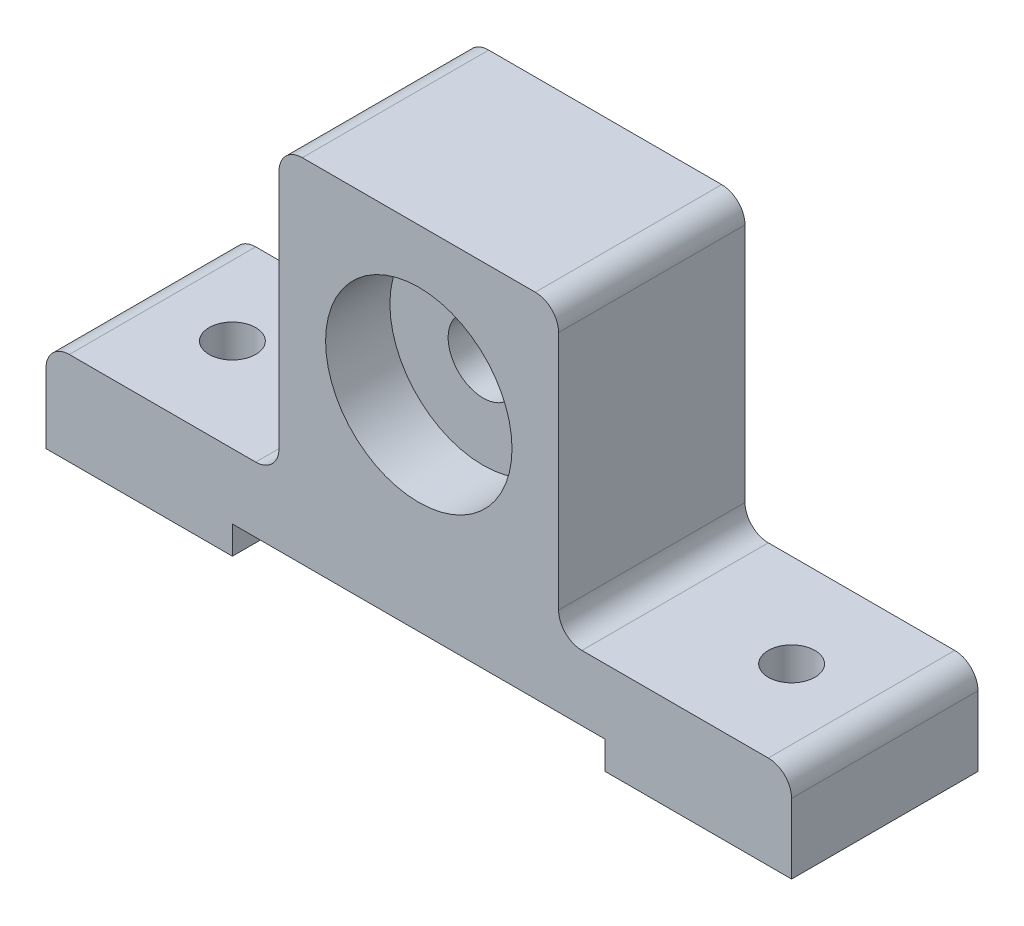
ISO-10303-21;
HEADER;
FILE_DESCRIPTION(('STEP AP214'),'2;1');
FILE_NAME('part.step','',(''),(''),'','','');
FILE_SCHEMA(('AUTOMOTIVE_DESIGN { 1 0 10303 214 1 1 1 1 }'));
ENDSEC;
DATA;
#1=APPLICATION_CONTEXT('core data for automotive mechanical design processes');
#2=APPLICATION_PROTOCOL_DEFINITION('international standard','automotive_design',2000,#1);
#3=PRODUCT_CONTEXT('',#1,'mechanical');
#4=PRODUCT('Part','Part','',(#3));
#5=PRODUCT_RELATED_PRODUCT_CATEGORY('part','',(#4));
#6=PRODUCT_DEFINITION_FORMATION('','',#4);
#7=PRODUCT_DEFINITION_CONTEXT('part definition',#1,'design');
#8=PRODUCT_DEFINITION('design','',#6,#7);
#9=PRODUCT_DEFINITION_SHAPE('','',#8);
#10=(LENGTH_UNIT() NAMED_UNIT(*) SI_UNIT(.MILLI.,.METRE.));
#11=(NAMED_UNIT(*) PLANE_ANGLE_UNIT() SI_UNIT($,.RADIAN.));
#12=(NAMED_UNIT(*) SI_UNIT($,.STERADIAN.) SOLID_ANGLE_UNIT());
#13=UNCERTAINTY_MEASURE_WITH_UNIT(LENGTH_MEASURE(1.E-05),#10,'distance_accuracy_value','');
#14=(GEOMETRIC_REPRESENTATION_CONTEXT(3) GLOBAL_UNCERTAINTY_ASSIGNED_CONTEXT((#13)) GLOBAL_UNIT_ASSIGNED_CONTEXT((#10,
#11,#12)) REPRESENTATION_CONTEXT('',''));
#15=CARTESIAN_POINT('',(0.,0.,0.));
#16=DIRECTION('',(0.,0.,1.));
#17=DIRECTION('',(1.,0.,0.));
#18=AXIS2_PLACEMENT_3D('',#15,#16,#17);
#19=CARTESIAN_POINT('',(101.6,63.5,-50.8));
#20=DIRECTION('',(0.,0.,1.));
#21=DIRECTION('',(1.,0.,0.));
#22=AXIS2_PLACEMENT_3D('',#19,#20,#21);
#23=CYLINDRICAL_SURFACE('',#22,9.52500000000001);
#24=CARTESIAN_POINT('',(101.6,63.5,-50.8));
#25=DIRECTION('',(0.,0.,1.));
#26=DIRECTION('',(1.,0.,0.));
#27=AXIS2_PLACEMENT_3D('',#24,#25,#26);
#28=CIRCLE('',#27,9.52500000000001);
#29=CARTESIAN_POINT('',(111.125,63.5,-50.8));
#30=VERTEX_POINT('',#29);
#31=EDGE_CURVE('E216',#30,#30,#28,.T.);
#32=ORIENTED_EDGE('',*,*,#31,.F.);
#33=EDGE_LOOP('',(#32));
#34=FACE_BOUND('',#33,.T.);
#35=CARTESIAN_POINT('',(101.6,63.5,-17.526));
#36=DIRECTION('',(0.,0.,1.));
#37=DIRECTION('',(1.,0.,0.));
#38=AXIS2_PLACEMENT_3D('',#35,#36,#37);
#39=CIRCLE('',#38,9.52500000000001);
#40=CARTESIAN_POINT('',(111.125,63.5,-17.526));
#41=VERTEX_POINT('',#40);
#42=EDGE_CURVE('E48',#41,#41,#39,.F.);
#43=ORIENTED_EDGE('',*,*,#42,.F.);
#44=EDGE_LOOP('',(#43));
#45=FACE_BOUND('',#44,.T.);
#46=ADVANCED_FACE('F44',(#34,#45),#23,.F.);
#47=CARTESIAN_POINT('',(0.,0.,-50.8));
#48=DIRECTION('',(-1.,0.,0.));
#49=DIRECTION('',(0.,0.,1.));
#50=AXIS2_PLACEMENT_3D('',#47,#48,#49);
#51=PLANE('',#50);
#52=DIRECTION('',(0.,-1.,0.));
#53=VECTOR('',#52,1.);
#54=CARTESIAN_POINT('',(0.,0.,0.));
#55=LINE('',#54,#53);
#56=CARTESIAN_POINT('',(0.,19.05,0.));
#57=VERTEX_POINT('',#56);
#58=CARTESIAN_POINT('',(0.,0.,0.));
#59=VERTEX_POINT('',#58);
#60=EDGE_CURVE('E211',#57,#59,#55,.T.);
#61=ORIENTED_EDGE('',*,*,#60,.F.);
#62=DIRECTION('',(0.,0.,1.));
#63=VECTOR('',#62,1.);
#64=CARTESIAN_POINT('',(0.,19.05,-50.8));
#65=LINE('',#64,#63);
#66=CARTESIAN_POINT('',(0.,19.05,-50.8));
#67=VERTEX_POINT('',#66);
#68=EDGE_CURVE('E11',#67,#57,#65,.T.);
#69=ORIENTED_EDGE('',*,*,#68,.F.);
#70=DIRECTION('',(0.,-1.,0.));
#71=VECTOR('',#70,1.);
#72=CARTESIAN_POINT('',(0.,0.,-50.8));
#73=LINE('',#72,#71);
#74=CARTESIAN_POINT('',(0.,0.,-50.8));
#75=VERTEX_POINT('',#74);
#76=EDGE_CURVE('E280',#67,#75,#73,.T.);
#77=ORIENTED_EDGE('',*,*,#76,.T.);
#78=DIRECTION('',(0.,0.,1.));
#79=VECTOR('',#78,1.);
#80=CARTESIAN_POINT('',(0.,0.,-50.8));
#81=LINE('',#80,#79);
#82=EDGE_CURVE('E132',#75,#59,#81,.T.);
#83=ORIENTED_EDGE('',*,*,#82,.T.);
#84=EDGE_LOOP('',(#61,#69,#77,#83));
#85=FACE_BOUND('',#84,.T.);
#86=ADVANCED_FACE('F46',(#85),#51,.T.);
#87=CARTESIAN_POINT('',(6.35,19.05,-50.8));
#88=DIRECTION('',(0.,0.,1.));
#89=DIRECTION('',(1.,0.,0.));
#90=AXIS2_PLACEMENT_3D('',#87,#88,#89);
#91=CYLINDRICAL_SURFACE('',#90,6.35);
#92=CARTESIAN_POINT('',(6.35,19.05,0.));
#93=DIRECTION('',(0.,0.,1.));
#94=DIRECTION('',(1.,0.,0.));
#95=AXIS2_PLACEMENT_3D('',#92,#93,#94);
#96=CIRCLE('',#95,6.35);
#97=CARTESIAN_POINT('',(6.35000000000004,25.4,0.));
#98=VERTEX_POINT('',#97);
#99=EDGE_CURVE('E277',#98,#57,#96,.T.);
#100=ORIENTED_EDGE('',*,*,#99,.F.);
#101=DIRECTION('',(0.,0.,1.));
#102=VECTOR('',#101,1.);
#103=CARTESIAN_POINT('',(6.35000000000004,25.4,-50.8));
#104=LINE('',#103,#102);
#105=CARTESIAN_POINT('',(6.35000000000004,25.4,-50.8));
#106=VERTEX_POINT('',#105);
#107=EDGE_CURVE('E55',#106,#98,#104,.T.);
#108=ORIENTED_EDGE('',*,*,#107,.F.);
#109=CARTESIAN_POINT('',(6.35,19.05,-50.8));
#110=DIRECTION('',(0.,0.,1.));
#111=DIRECTION('',(1.,0.,0.));
#112=AXIS2_PLACEMENT_3D('',#109,#110,#111);
#113=CIRCLE('',#112,6.35);
#114=EDGE_CURVE('E195',#106,#67,#113,.T.);
#115=ORIENTED_EDGE('',*,*,#114,.T.);
#116=ORIENTED_EDGE('',*,*,#68,.T.);
#117=EDGE_LOOP('',(#100,#108,#115,#116));
#118=FACE_BOUND('',#117,.T.);
#119=ADVANCED_FACE('F331',(#118),#91,.T.);
#120=CARTESIAN_POINT('',(6.35000000000004,25.4,-50.8));
#121=DIRECTION('',(0.,1.,0.));
#122=DIRECTION('',(0.,0.,1.));
#123=AXIS2_PLACEMENT_3D('',#120,#121,#122);
#124=PLANE('',#123);
#125=CARTESIAN_POINT('',(25.4,25.4,-25.4));
#126=DIRECTION('',(0.,1.,0.));
#127=DIRECTION('',(0.,0.,1.));
#128=AXIS2_PLACEMENT_3D('',#125,#126,#127);
#129=CIRCLE('',#128,6.35);
#130=CARTESIAN_POINT('',(25.4,25.4,-19.05));
#131=VERTEX_POINT('',#130);
#132=EDGE_CURVE('E376',#131,#131,#129,.T.);
#133=ORIENTED_EDGE('',*,*,#132,.F.);
#134=EDGE_LOOP('',(#133));
#135=FACE_BOUND('',#134,.T.);
#136=DIRECTION('',(-1.,0.,0.));
#137=VECTOR('',#136,1.);
#138=CARTESIAN_POINT('',(6.35000000000004,25.4,0.));
#139=LINE('',#138,#137);
#140=CARTESIAN_POINT('',(57.15,25.4,0.));
#141=VERTEX_POINT('',#140);
#142=EDGE_CURVE('E181',#141,#98,#139,.T.);
#143=ORIENTED_EDGE('',*,*,#142,.F.);
#144=DIRECTION('',(0.,0.,1.));
#145=VECTOR('',#144,1.);
#146=CARTESIAN_POINT('',(57.15,25.4,-50.8));
#147=LINE('',#146,#145);
#148=CARTESIAN_POINT('',(57.15,25.4,-50.8));
#149=VERTEX_POINT('',#148);
#150=EDGE_CURVE('E176',#149,#141,#147,.T.);
#151=ORIENTED_EDGE('',*,*,#150,.F.);
#152=DIRECTION('',(-1.,0.,0.));
#153=VECTOR('',#152,1.);
#154=CARTESIAN_POINT('',(6.35000000000004,25.4,-50.8));
#155=LINE('',#154,#153);
#156=EDGE_CURVE('E179',#149,#106,#155,.T.);
#157=ORIENTED_EDGE('',*,*,#156,.T.);
#158=ORIENTED_EDGE('',*,*,#107,.T.);
#159=EDGE_LOOP('',(#143,#151,#157,#158));
#160=FACE_BOUND('',#159,.T.);
#161=ADVANCED_FACE('F178',(#135,#160),#124,.T.);
#162=CARTESIAN_POINT('',(57.15,31.75,-50.8));
#163=DIRECTION('',(0.,0.,1.));
#164=DIRECTION('',(1.,0.,0.));
#165=AXIS2_PLACEMENT_3D('',#162,#163,#164);
#166=CYLINDRICAL_SURFACE('',#165,6.35);
#167=CARTESIAN_POINT('',(57.15,31.75,0.));
#168=DIRECTION('',(0.,0.,-1.));
#169=DIRECTION('',(1.,0.,0.));
#170=AXIS2_PLACEMENT_3D('',#167,#168,#169);
#171=CIRCLE('',#170,6.35);
#172=CARTESIAN_POINT('',(63.5,31.75,0.));
#173=VERTEX_POINT('',#172);
#174=EDGE_CURVE('E272',#173,#141,#171,.T.);
#175=ORIENTED_EDGE('',*,*,#174,.F.);
#176=DIRECTION('',(0.,0.,1.));
#177=VECTOR('',#176,1.);
#178=CARTESIAN_POINT('',(63.5,31.75,-50.8));
#179=LINE('',#178,#177);
#180=CARTESIAN_POINT('',(63.5,31.75,-50.8));
#181=VERTEX_POINT('',#180);
#182=EDGE_CURVE('E187',#181,#173,#179,.T.);
#183=ORIENTED_EDGE('',*,*,#182,.F.);
#184=CARTESIAN_POINT('',(57.15,31.75,-50.8));
#185=DIRECTION('',(0.,0.,-1.));
#186=DIRECTION('',(1.,0.,0.));
#187=AXIS2_PLACEMENT_3D('',#184,#185,#186);
#188=CIRCLE('',#187,6.35);
#189=EDGE_CURVE('E193',#181,#149,#188,.T.);
#190=ORIENTED_EDGE('',*,*,#189,.T.);
#191=ORIENTED_EDGE('',*,*,#150,.T.);
#192=EDGE_LOOP('',(#175,#183,#190,#191));
#193=FACE_BOUND('',#192,.T.);
#194=ADVANCED_FACE('F198',(#193),#166,.F.);
#195=CARTESIAN_POINT('',(63.5,31.75,-50.8));
#196=DIRECTION('',(-1.,0.,0.));
#197=DIRECTION('',(0.,0.,1.));
#198=AXIS2_PLACEMENT_3D('',#195,#196,#197);
#199=PLANE('',#198);
#200=DIRECTION('',(0.,-1.,0.));
#201=VECTOR('',#200,1.);
#202=CARTESIAN_POINT('',(63.5,31.75,0.));
#203=LINE('',#202,#201);
#204=CARTESIAN_POINT('',(63.5,97.2433828797224,0.));
#205=VERTEX_POINT('',#204);
#206=EDGE_CURVE('E268',#205,#173,#203,.T.);
#207=ORIENTED_EDGE('',*,*,#206,.F.);
#208=DIRECTION('',(0.,0.,1.));
#209=VECTOR('',#208,1.);
#210=CARTESIAN_POINT('',(63.5,97.2433828797224,-50.8));
#211=LINE('',#210,#209);
#212=CARTESIAN_POINT('',(63.5,97.2433828797224,-50.8));
#213=VERTEX_POINT('',#212);
#214=EDGE_CURVE('E286',#213,#205,#211,.T.);
#215=ORIENTED_EDGE('',*,*,#214,.F.);
#216=DIRECTION('',(0.,-1.,0.));
#217=VECTOR('',#216,1.);
#218=CARTESIAN_POINT('',(63.5,31.75,-50.8));
#219=LINE('',#218,#217);
#220=EDGE_CURVE('E200',#213,#181,#219,.T.);
#221=ORIENTED_EDGE('',*,*,#220,.T.);
#222=ORIENTED_EDGE('',*,*,#182,.T.);
#223=EDGE_LOOP('',(#207,#215,#221,#222));
#224=FACE_BOUND('',#223,.T.);
#225=ADVANCED_FACE('F484',(#224),#199,.T.);
#226=CARTESIAN_POINT('',(69.85,97.2433828797224,-50.8));
#227=DIRECTION('',(0.,0.,1.));
#228=DIRECTION('',(1.,0.,0.));
#229=AXIS2_PLACEMENT_3D('',#226,#227,#228);
#230=CYLINDRICAL_SURFACE('',#229,6.34999999999999);
#231=CARTESIAN_POINT('',(69.85,97.2433828797224,0.));
#232=DIRECTION('',(0.,0.,1.));
#233=DIRECTION('',(-1.,0.,0.));
#234=AXIS2_PLACEMENT_3D('',#231,#232,#233);
#235=CIRCLE('',#234,6.34999999999999);
#236=CARTESIAN_POINT('',(69.8500000000001,103.593382879722,0.));
#237=VERTEX_POINT('',#236);
#238=EDGE_CURVE('E264',#237,#205,#235,.T.);
#239=ORIENTED_EDGE('',*,*,#238,.F.);
#240=DIRECTION('',(0.,0.,1.));
#241=VECTOR('',#240,1.);
#242=CARTESIAN_POINT('',(69.8500000000001,103.593382879722,-50.8));
#243=LINE('',#242,#241);
#244=CARTESIAN_POINT('',(69.8500000000001,103.593382879722,-50.8));
#245=VERTEX_POINT('',#244);
#246=EDGE_CURVE('E289',#245,#237,#243,.T.);
#247=ORIENTED_EDGE('',*,*,#246,.F.);
#248=CARTESIAN_POINT('',(69.85,97.2433828797224,-50.8));
#249=DIRECTION('',(0.,0.,1.));
#250=DIRECTION('',(-1.,0.,0.));
#251=AXIS2_PLACEMENT_3D('',#248,#249,#250);
#252=CIRCLE('',#251,6.34999999999999);
#253=EDGE_CURVE('E205',#245,#213,#252,.T.);
#254=ORIENTED_EDGE('',*,*,#253,.T.);
#255=ORIENTED_EDGE('',*,*,#214,.T.);
#256=EDGE_LOOP('',(#239,#247,#254,#255));
#257=FACE_BOUND('',#256,.T.);
#258=ADVANCED_FACE('F438',(#257),#230,.T.);
#259=CARTESIAN_POINT('',(69.8500000000001,103.593382879722,-50.8));
#260=DIRECTION('',(0.,1.,0.));
#261=DIRECTION('',(0.,0.,1.));
#262=AXIS2_PLACEMENT_3D('',#259,#260,#261);
#263=PLANE('',#262);
#264=DIRECTION('',(-1.,0.,0.));
#265=VECTOR('',#264,1.);
#266=CARTESIAN_POINT('',(69.8500000000001,103.593382879722,0.));
#267=LINE('',#266,#265);
#268=CARTESIAN_POINT('',(133.35,103.593382879722,0.));
#269=VERTEX_POINT('',#268);
#270=EDGE_CURVE('E260',#269,#237,#267,.T.);
#271=ORIENTED_EDGE('',*,*,#270,.F.);
#272=DIRECTION('',(0.,0.,1.));
#273=VECTOR('',#272,1.);
#274=CARTESIAN_POINT('',(133.35,103.593382879722,-50.8));
#275=LINE('',#274,#273);
#276=CARTESIAN_POINT('',(133.35,103.593382879722,-50.8));
#277=VERTEX_POINT('',#276);
#278=EDGE_CURVE('E292',#277,#269,#275,.T.);
#279=ORIENTED_EDGE('',*,*,#278,.F.);
#280=DIRECTION('',(-1.,0.,0.));
#281=VECTOR('',#280,1.);
#282=CARTESIAN_POINT('',(69.8500000000001,103.593382879722,-50.8));
#283=LINE('',#282,#281);
#284=EDGE_CURVE('E428',#277,#245,#283,.T.);
#285=ORIENTED_EDGE('',*,*,#284,.T.);
#286=ORIENTED_EDGE('',*,*,#246,.T.);
#287=EDGE_LOOP('',(#271,#279,#285,#286));
#288=FACE_BOUND('',#287,.T.);
#289=ADVANCED_FACE('F444',(#288),#263,.T.);
#290=CARTESIAN_POINT('',(133.35,97.2433828797224,-50.8));
#291=DIRECTION('',(0.,0.,1.));
#292=DIRECTION('',(1.,0.,0.));
#293=AXIS2_PLACEMENT_3D('',#290,#291,#292);
#294=CYLINDRICAL_SURFACE('',#293,6.34999999999999);
#295=CARTESIAN_POINT('',(133.35,97.2433828797224,0.));
#296=DIRECTION('',(0.,0.,1.));
#297=DIRECTION('',(1.,0.,0.));
#298=AXIS2_PLACEMENT_3D('',#295,#296,#297);
#299=CIRCLE('',#298,6.34999999999999);
#300=CARTESIAN_POINT('',(139.7,97.2433828797224,0.));
#301=VERTEX_POINT('',#300);
#302=EDGE_CURVE('E256',#301,#269,#299,.T.);
#303=ORIENTED_EDGE('',*,*,#302,.F.);
#304=DIRECTION('',(0.,0.,1.));
#305=VECTOR('',#304,1.);
#306=CARTESIAN_POINT('',(139.7,97.2433828797224,-50.8));
#307=LINE('',#306,#305);
#308=CARTESIAN_POINT('',(139.7,97.2433828797224,-50.8));
#309=VERTEX_POINT('',#308);
#310=EDGE_CURVE('E295',#309,#301,#307,.T.);
#311=ORIENTED_EDGE('',*,*,#310,.F.);
#312=CARTESIAN_POINT('',(133.35,97.2433828797224,-50.8));
#313=DIRECTION('',(0.,0.,1.));
#314=DIRECTION('',(1.,0.,0.));
#315=AXIS2_PLACEMENT_3D('',#312,#313,#314);
#316=CIRCLE('',#315,6.34999999999999);
#317=EDGE_CURVE('E424',#309,#277,#316,.T.);
#318=ORIENTED_EDGE('',*,*,#317,.T.);
#319=ORIENTED_EDGE('',*,*,#278,.T.);
#320=EDGE_LOOP('',(#303,#311,#318,#319));
#321=FACE_BOUND('',#320,.T.);
#322=ADVANCED_FACE('F447',(#321),#294,.T.);
#323=CARTESIAN_POINT('',(139.7,97.2433828797224,-50.8));
#324=DIRECTION('',(1.,0.,0.));
#325=DIRECTION('',(0.,0.,-1.));
#326=AXIS2_PLACEMENT_3D('',#323,#324,#325);
#327=PLANE('',#326);
#328=DIRECTION('',(0.,1.,0.));
#329=VECTOR('',#328,1.);
#330=CARTESIAN_POINT('',(139.7,97.2433828797224,0.));
#331=LINE('',#330,#329);
#332=CARTESIAN_POINT('',(139.7,31.75,0.));
#333=VERTEX_POINT('',#332);
#334=EDGE_CURVE('E252',#333,#301,#331,.T.);
#335=ORIENTED_EDGE('',*,*,#334,.F.);
#336=DIRECTION('',(0.,0.,1.));
#337=VECTOR('',#336,1.);
#338=CARTESIAN_POINT('',(139.7,31.75,-50.8));
#339=LINE('',#338,#337);
#340=CARTESIAN_POINT('',(139.7,31.75,-50.8));
#341=VERTEX_POINT('',#340);
#342=EDGE_CURVE('E298',#341,#333,#339,.T.);
#343=ORIENTED_EDGE('',*,*,#342,.F.);
#344=DIRECTION('',(0.,1.,0.));
#345=VECTOR('',#344,1.);
#346=CARTESIAN_POINT('',(139.7,97.2433828797224,-50.8));
#347=LINE('',#346,#345);
#348=EDGE_CURVE('E420',#341,#309,#347,.T.);
#349=ORIENTED_EDGE('',*,*,#348,.T.);
#350=ORIENTED_EDGE('',*,*,#310,.T.);
#351=EDGE_LOOP('',(#335,#343,#349,#350));
#352=FACE_BOUND('',#351,.T.);
#353=ADVANCED_FACE('F452',(#352),#327,.T.);
#354=CARTESIAN_POINT('',(146.05,31.75,-50.8));
#355=DIRECTION('',(0.,0.,1.));
#356=DIRECTION('',(1.,0.,0.));
#357=AXIS2_PLACEMENT_3D('',#354,#355,#356);
#358=CYLINDRICAL_SURFACE('',#357,6.35);
#359=CARTESIAN_POINT('',(146.05,31.75,0.));
#360=DIRECTION('',(0.,0.,-1.));
#361=DIRECTION('',(1.,0.,0.));
#362=AXIS2_PLACEMENT_3D('',#359,#360,#361);
#363=CIRCLE('',#362,6.35);
#364=CARTESIAN_POINT('',(146.05,25.4,0.));
#365=VERTEX_POINT('',#364);
#366=EDGE_CURVE('E248',#365,#333,#363,.T.);
#367=ORIENTED_EDGE('',*,*,#366,.F.);
#368=DIRECTION('',(0.,0.,1.));
#369=VECTOR('',#368,1.);
#370=CARTESIAN_POINT('',(146.05,25.4,-50.8));
#371=LINE('',#370,#369);
#372=CARTESIAN_POINT('',(146.05,25.4,-50.8));
#373=VERTEX_POINT('',#372);
#374=EDGE_CURVE('E301',#373,#365,#371,.T.);
#375=ORIENTED_EDGE('',*,*,#374,.F.);
#376=CARTESIAN_POINT('',(146.05,31.75,-50.8));
#377=DIRECTION('',(0.,0.,-1.));
#378=DIRECTION('',(1.,0.,0.));
#379=AXIS2_PLACEMENT_3D('',#376,#377,#378);
#380=CIRCLE('',#379,6.35);
#381=EDGE_CURVE('E416',#373,#341,#380,.T.);
#382=ORIENTED_EDGE('',*,*,#381,.T.);
#383=ORIENTED_EDGE('',*,*,#342,.T.);
#384=EDGE_LOOP('',(#367,#375,#382,#383));
#385=FACE_BOUND('',#384,.T.);
#386=ADVANCED_FACE('F455',(#385),#358,.F.);
#387=CARTESIAN_POINT('',(146.05,25.4,-50.8));
#388=DIRECTION('',(0.,1.,0.));
#389=DIRECTION('',(0.,0.,1.));
#390=AXIS2_PLACEMENT_3D('',#387,#388,#389);
#391=PLANE('',#390);
#392=CARTESIAN_POINT('',(177.8,25.4,-25.4));
#393=DIRECTION('',(0.,1.,0.));
#394=DIRECTION('',(0.,0.,1.));
#395=AXIS2_PLACEMENT_3D('',#392,#393,#394);
#396=CIRCLE('',#395,6.35);
#397=CARTESIAN_POINT('',(177.8,25.4,-19.05));
#398=VERTEX_POINT('',#397);
#399=EDGE_CURVE('E536',#398,#398,#396,.T.);
#400=ORIENTED_EDGE('',*,*,#399,.F.);
#401=EDGE_LOOP('',(#400));
#402=FACE_BOUND('',#401,.T.);
#403=DIRECTION('',(-1.,0.,0.));
#404=VECTOR('',#403,1.);
#405=CARTESIAN_POINT('',(146.05,25.4,0.));
#406=LINE('',#405,#404);
#407=CARTESIAN_POINT('',(196.85,25.4,0.));
#408=VERTEX_POINT('',#407);
#409=EDGE_CURVE('E244',#408,#365,#406,.T.);
#410=ORIENTED_EDGE('',*,*,#409,.F.);
#411=DIRECTION('',(0.,0.,1.));
#412=VECTOR('',#411,1.);
#413=CARTESIAN_POINT('',(196.85,25.4,-50.8));
#414=LINE('',#413,#412);
#415=CARTESIAN_POINT('',(196.85,25.4,-50.8));
#416=VERTEX_POINT('',#415);
#417=EDGE_CURVE('E304',#416,#408,#414,.T.);
#418=ORIENTED_EDGE('',*,*,#417,.F.);
#419=DIRECTION('',(-1.,0.,0.));
#420=VECTOR('',#419,1.);
#421=CARTESIAN_POINT('',(146.05,25.4,-50.8));
#422=LINE('',#421,#420);
#423=EDGE_CURVE('E412',#416,#373,#422,.T.);
#424=ORIENTED_EDGE('',*,*,#423,.T.);
#425=ORIENTED_EDGE('',*,*,#374,.T.);
#426=EDGE_LOOP('',(#410,#418,#424,#425));
#427=FACE_BOUND('',#426,.T.);
#428=ADVANCED_FACE('F460',(#402,#427),#391,.T.);
#429=CARTESIAN_POINT('',(196.85,19.05,-50.8));
#430=DIRECTION('',(0.,0.,1.));
#431=DIRECTION('',(1.,0.,0.));
#432=AXIS2_PLACEMENT_3D('',#429,#430,#431);
#433=CYLINDRICAL_SURFACE('',#432,6.35);
#434=CARTESIAN_POINT('',(196.85,19.05,0.));
#435=DIRECTION('',(0.,0.,1.));
#436=DIRECTION('',(-1.,0.,0.));
#437=AXIS2_PLACEMENT_3D('',#434,#435,#436);
#438=CIRCLE('',#437,6.35);
#439=CARTESIAN_POINT('',(203.2,19.05,0.));
#440=VERTEX_POINT('',#439);
#441=EDGE_CURVE('E240',#440,#408,#438,.T.);
#442=ORIENTED_EDGE('',*,*,#441,.F.);
#443=DIRECTION('',(0.,0.,1.));
#444=VECTOR('',#443,1.);
#445=CARTESIAN_POINT('',(203.2,19.05,-50.8));
#446=LINE('',#445,#444);
#447=CARTESIAN_POINT('',(203.2,19.05,-50.8));
#448=VERTEX_POINT('',#447);
#449=EDGE_CURVE('E307',#448,#440,#446,.T.);
#450=ORIENTED_EDGE('',*,*,#449,.F.);
#451=CARTESIAN_POINT('',(196.85,19.05,-50.8));
#452=DIRECTION('',(0.,0.,1.));
#453=DIRECTION('',(-1.,0.,0.));
#454=AXIS2_PLACEMENT_3D('',#451,#452,#453);
#455=CIRCLE('',#454,6.35);
#456=EDGE_CURVE('E408',#448,#416,#455,.T.);
#457=ORIENTED_EDGE('',*,*,#456,.T.);
#458=ORIENTED_EDGE('',*,*,#417,.T.);
#459=EDGE_LOOP('',(#442,#450,#457,#458));
#460=FACE_BOUND('',#459,.T.);
#461=ADVANCED_FACE('F463',(#460),#433,.T.);
#462=CARTESIAN_POINT('',(203.2,0.,-50.8));
#463=DIRECTION('',(1.,0.,0.));
#464=DIRECTION('',(0.,0.,-1.));
#465=AXIS2_PLACEMENT_3D('',#462,#463,#464);
#466=PLANE('',#465);
#467=DIRECTION('',(0.,1.,0.));
#468=VECTOR('',#467,1.);
#469=CARTESIAN_POINT('',(203.2,0.,0.));
#470=LINE('',#469,#468);
#471=CARTESIAN_POINT('',(203.2,0.,0.));
#472=VERTEX_POINT('',#471);
#473=EDGE_CURVE('E236',#472,#440,#470,.T.);
#474=ORIENTED_EDGE('',*,*,#473,.F.);
#475=DIRECTION('',(0.,0.,1.));
#476=VECTOR('',#475,1.);
#477=CARTESIAN_POINT('',(203.2,0.,-50.8));
#478=LINE('',#477,#476);
#479=CARTESIAN_POINT('',(203.2,0.,-50.8));
#480=VERTEX_POINT('',#479);
#481=EDGE_CURVE('E310',#480,#472,#478,.T.);
#482=ORIENTED_EDGE('',*,*,#481,.F.);
#483=DIRECTION('',(0.,1.,0.));
#484=VECTOR('',#483,1.);
#485=CARTESIAN_POINT('',(203.2,0.,-50.8));
#486=LINE('',#485,#484);
#487=EDGE_CURVE('E404',#480,#448,#486,.T.);
#488=ORIENTED_EDGE('',*,*,#487,.T.);
#489=ORIENTED_EDGE('',*,*,#449,.T.);
#490=EDGE_LOOP('',(#474,#482,#488,#489));
#491=FACE_BOUND('',#490,.T.);
#492=ADVANCED_FACE('F468',(#491),#466,.T.);
#493=CARTESIAN_POINT('',(152.4,0.,-50.8));
#494=DIRECTION('',(0.,-1.,0.));
#495=DIRECTION('',(0.,0.,-1.));
#496=AXIS2_PLACEMENT_3D('',#493,#494,#495);
#497=PLANE('',#496);
#498=CARTESIAN_POINT('',(177.8,0.,-25.4));
#499=DIRECTION('',(0.,1.,0.));
#500=DIRECTION('',(0.,0.,1.));
#501=AXIS2_PLACEMENT_3D('',#498,#499,#500);
#502=CIRCLE('',#501,6.35);
#503=CARTESIAN_POINT('',(177.8,0.,-19.05));
#504=VERTEX_POINT('',#503);
#505=EDGE_CURVE('E531',#504,#504,#502,.T.);
#506=ORIENTED_EDGE('',*,*,#505,.T.);
#507=EDGE_LOOP('',(#506));
#508=FACE_BOUND('',#507,.T.);
#509=DIRECTION('',(1.,0.,0.));
#510=VECTOR('',#509,1.);
#511=CARTESIAN_POINT('',(152.4,0.,0.));
#512=LINE('',#511,#510);
#513=CARTESIAN_POINT('',(152.4,0.,0.));
#514=VERTEX_POINT('',#513);
#515=EDGE_CURVE('E232',#514,#472,#512,.T.);
#516=ORIENTED_EDGE('',*,*,#515,.F.);
#517=DIRECTION('',(0.,0.,1.));
#518=VECTOR('',#517,1.);
#519=CARTESIAN_POINT('',(152.4,0.,-50.8));
#520=LINE('',#519,#518);
#521=CARTESIAN_POINT('',(152.4,0.,-50.8));
#522=VERTEX_POINT('',#521);
#523=EDGE_CURVE('E313',#522,#514,#520,.T.);
#524=ORIENTED_EDGE('',*,*,#523,.F.);
#525=DIRECTION('',(1.,0.,0.));
#526=VECTOR('',#525,1.);
#527=CARTESIAN_POINT('',(152.4,0.,-50.8));
#528=LINE('',#527,#526);
#529=EDGE_CURVE('E400',#522,#480,#528,.T.);
#530=ORIENTED_EDGE('',*,*,#529,.T.);
#531=ORIENTED_EDGE('',*,*,#481,.T.);
#532=EDGE_LOOP('',(#516,#524,#530,#531));
#533=FACE_BOUND('',#532,.T.);
#534=ADVANCED_FACE('F471',(#508,#533),#497,.T.);
#535=CARTESIAN_POINT('',(152.4,7.62,-50.8));
#536=DIRECTION('',(-1.,0.,0.));
#537=DIRECTION('',(0.,0.,1.));
#538=AXIS2_PLACEMENT_3D('',#535,#536,#537);
#539=PLANE('',#538);
#540=DIRECTION('',(0.,-1.,0.));
#541=VECTOR('',#540,1.);
#542=CARTESIAN_POINT('',(152.4,7.62,0.));
#543=LINE('',#542,#541);
#544=CARTESIAN_POINT('',(152.4,7.62,0.));
#545=VERTEX_POINT('',#544);
#546=EDGE_CURVE('E228',#545,#514,#543,.T.);
#547=ORIENTED_EDGE('',*,*,#546,.F.);
#548=DIRECTION('',(0.,0.,1.));
#549=VECTOR('',#548,1.);
#550=CARTESIAN_POINT('',(152.4,7.62,-50.8));
#551=LINE('',#550,#549);
#552=CARTESIAN_POINT('',(152.4,7.62,-50.8));
#553=VERTEX_POINT('',#552);
#554=EDGE_CURVE('E316',#553,#545,#551,.T.);
#555=ORIENTED_EDGE('',*,*,#554,.F.);
#556=DIRECTION('',(0.,-1.,0.));
#557=VECTOR('',#556,1.);
#558=CARTESIAN_POINT('',(152.4,7.62,-50.8));
#559=LINE('',#558,#557);
#560=EDGE_CURVE('E396',#553,#522,#559,.T.);
#561=ORIENTED_EDGE('',*,*,#560,.T.);
#562=ORIENTED_EDGE('',*,*,#523,.T.);
#563=EDGE_LOOP('',(#547,#555,#561,#562));
#564=FACE_BOUND('',#563,.T.);
#565=ADVANCED_FACE('F476',(#564),#539,.T.);
#566=CARTESIAN_POINT('',(50.8,7.62,-50.8));
#567=DIRECTION('',(0.,-1.,0.));
#568=DIRECTION('',(0.,0.,-1.));
#569=AXIS2_PLACEMENT_3D('',#566,#567,#568);
#570=PLANE('',#569);
#571=DIRECTION('',(1.,0.,0.));
#572=VECTOR('',#571,1.);
#573=CARTESIAN_POINT('',(50.8,7.62,0.));
#574=LINE('',#573,#572);
#575=CARTESIAN_POINT('',(50.8,7.62,0.));
#576=VERTEX_POINT('',#575);
#577=EDGE_CURVE('E224',#576,#545,#574,.T.);
#578=ORIENTED_EDGE('',*,*,#577,.F.);
#579=DIRECTION('',(0.,0.,1.));
#580=VECTOR('',#579,1.);
#581=CARTESIAN_POINT('',(50.8,7.62,-50.8));
#582=LINE('',#581,#580);
#583=CARTESIAN_POINT('',(50.8,7.62,-50.8));
#584=VERTEX_POINT('',#583);
#585=EDGE_CURVE('E319',#584,#576,#582,.T.);
#586=ORIENTED_EDGE('',*,*,#585,.F.);
#587=DIRECTION('',(1.,0.,0.));
#588=VECTOR('',#587,1.);
#589=CARTESIAN_POINT('',(50.8,7.62,-50.8));
#590=LINE('',#589,#588);
#591=EDGE_CURVE('E392',#584,#553,#590,.T.);
#592=ORIENTED_EDGE('',*,*,#591,.T.);
#593=ORIENTED_EDGE('',*,*,#554,.T.);
#594=EDGE_LOOP('',(#578,#586,#592,#593));
#595=FACE_BOUND('',#594,.T.);
#596=ADVANCED_FACE('F479',(#595),#570,.T.);
#597=CARTESIAN_POINT('',(50.8,0.,-50.8));
#598=DIRECTION('',(1.,0.,0.));
#599=DIRECTION('',(0.,0.,-1.));
#600=AXIS2_PLACEMENT_3D('',#597,#598,#599);
#601=PLANE('',#600);
#602=DIRECTION('',(0.,1.,0.));
#603=VECTOR('',#602,1.);
#604=CARTESIAN_POINT('',(50.8,0.,0.));
#605=LINE('',#604,#603);
#606=CARTESIAN_POINT('',(50.8,0.,0.));
#607=VERTEX_POINT('',#606);
#608=EDGE_CURVE('E220',#607,#576,#605,.T.);
#609=ORIENTED_EDGE('',*,*,#608,.F.);
#610=DIRECTION('',(0.,0.,1.));
#611=VECTOR('',#610,1.);
#612=CARTESIAN_POINT('',(50.8,0.,-50.8));
#613=LINE('',#612,#611);
#614=CARTESIAN_POINT('',(50.8,0.,-50.8));
#615=VERTEX_POINT('',#614);
#616=EDGE_CURVE('E322',#615,#607,#613,.T.);
#617=ORIENTED_EDGE('',*,*,#616,.F.);
#618=DIRECTION('',(0.,1.,0.));
#619=VECTOR('',#618,1.);
#620=CARTESIAN_POINT('',(50.8,0.,-50.8));
#621=LINE('',#620,#619);
#622=EDGE_CURVE('E388',#615,#584,#621,.T.);
#623=ORIENTED_EDGE('',*,*,#622,.T.);
#624=ORIENTED_EDGE('',*,*,#585,.T.);
#625=EDGE_LOOP('',(#609,#617,#623,#624));
#626=FACE_BOUND('',#625,.T.);
#627=ADVANCED_FACE('F482',(#626),#601,.T.);
#628=CARTESIAN_POINT('',(0.,0.,-50.8));
#629=DIRECTION('',(0.,-1.,0.));
#630=DIRECTION('',(0.,0.,-1.));
#631=AXIS2_PLACEMENT_3D('',#628,#629,#630);
#632=PLANE('',#631);
#633=CARTESIAN_POINT('',(25.4,0.,-25.4));
#634=DIRECTION('',(0.,1.,0.));
#635=DIRECTION('',(0.,0.,1.));
#636=AXIS2_PLACEMENT_3D('',#633,#634,#635);
#637=CIRCLE('',#636,6.35);
#638=CARTESIAN_POINT('',(25.4,0.,-19.05));
#639=VERTEX_POINT('',#638);
#640=EDGE_CURVE('E367',#639,#639,#637,.T.);
#641=ORIENTED_EDGE('',*,*,#640,.T.);
#642=EDGE_LOOP('',(#641));
#643=FACE_BOUND('',#642,.T.);
#644=DIRECTION('',(1.,0.,0.));
#645=VECTOR('',#644,1.);
#646=CARTESIAN_POINT('',(0.,0.,0.));
#647=LINE('',#646,#645);
#648=EDGE_CURVE('E215',#59,#607,#647,.T.);
#649=ORIENTED_EDGE('',*,*,#648,.F.);
#650=ORIENTED_EDGE('',*,*,#82,.F.);
#651=DIRECTION('',(1.,0.,0.));
#652=VECTOR('',#651,1.);
#653=CARTESIAN_POINT('',(0.,0.,-50.8));
#654=LINE('',#653,#652);
#655=EDGE_CURVE('E385',#75,#615,#654,.T.);
#656=ORIENTED_EDGE('',*,*,#655,.T.);
#657=ORIENTED_EDGE('',*,*,#616,.T.);
#658=EDGE_LOOP('',(#649,#650,#656,#657));
#659=FACE_BOUND('',#658,.T.);
#660=ADVANCED_FACE('F327',(#643,#659),#632,.T.);
#661=CARTESIAN_POINT('',(6.35,19.05,-50.8));
#662=DIRECTION('',(0.,0.,1.));
#663=DIRECTION('',(1.,0.,0.));
#664=AXIS2_PLACEMENT_3D('',#661,#662,#663);
#665=PLANE('',#664);
#666=ORIENTED_EDGE('',*,*,#31,.T.);
#667=EDGE_LOOP('',(#666));
#668=FACE_BOUND('',#667,.T.);
#669=ORIENTED_EDGE('',*,*,#76,.F.);
#670=ORIENTED_EDGE('',*,*,#114,.F.);
#671=ORIENTED_EDGE('',*,*,#156,.F.);
#672=ORIENTED_EDGE('',*,*,#189,.F.);
#673=ORIENTED_EDGE('',*,*,#220,.F.);
#674=ORIENTED_EDGE('',*,*,#253,.F.);
#675=ORIENTED_EDGE('',*,*,#284,.F.);
#676=ORIENTED_EDGE('',*,*,#317,.F.);
#677=ORIENTED_EDGE('',*,*,#348,.F.);
#678=ORIENTED_EDGE('',*,*,#381,.F.);
#679=ORIENTED_EDGE('',*,*,#423,.F.);
#680=ORIENTED_EDGE('',*,*,#456,.F.);
#681=ORIENTED_EDGE('',*,*,#487,.F.);
#682=ORIENTED_EDGE('',*,*,#529,.F.);
#683=ORIENTED_EDGE('',*,*,#560,.F.);
#684=ORIENTED_EDGE('',*,*,#591,.F.);
#685=ORIENTED_EDGE('',*,*,#622,.F.);
#686=ORIENTED_EDGE('',*,*,#655,.F.);
#687=EDGE_LOOP('',(#669,#670,#671,#672,#673,#674,#675,#676,#677,#678,#679,#680,#681,#682,#683,
#684,#685,#686));
#688=FACE_BOUND('',#687,.T.);
#689=ADVANCED_FACE('F191',(#668,#688),#665,.F.);
#690=CARTESIAN_POINT('',(6.35,19.05,0.));
#691=DIRECTION('',(0.,0.,1.));
#692=DIRECTION('',(1.,0.,0.));
#693=AXIS2_PLACEMENT_3D('',#690,#691,#692);
#694=PLANE('',#693);
#695=CARTESIAN_POINT('',(101.6,63.5,0.));
#696=DIRECTION('',(0.,0.,1.));
#697=DIRECTION('',(1.,0.,0.));
#698=AXIS2_PLACEMENT_3D('',#695,#696,#697);
#699=CIRCLE('',#698,25.4);
#700=CARTESIAN_POINT('',(127.,63.5,0.));
#701=VERTEX_POINT('',#700);
#702=EDGE_CURVE('E363',#701,#701,#699,.T.);
#703=ORIENTED_EDGE('',*,*,#702,.F.);
#704=EDGE_LOOP('',(#703));
#705=FACE_BOUND('',#704,.T.);
#706=ORIENTED_EDGE('',*,*,#60,.T.);
#707=ORIENTED_EDGE('',*,*,#648,.T.);
#708=ORIENTED_EDGE('',*,*,#608,.T.);
#709=ORIENTED_EDGE('',*,*,#577,.T.);
#710=ORIENTED_EDGE('',*,*,#546,.T.);
#711=ORIENTED_EDGE('',*,*,#515,.T.);
#712=ORIENTED_EDGE('',*,*,#473,.T.);
#713=ORIENTED_EDGE('',*,*,#441,.T.);
#714=ORIENTED_EDGE('',*,*,#409,.T.);
#715=ORIENTED_EDGE('',*,*,#366,.T.);
#716=ORIENTED_EDGE('',*,*,#334,.T.);
#717=ORIENTED_EDGE('',*,*,#302,.T.);
#718=ORIENTED_EDGE('',*,*,#270,.T.);
#719=ORIENTED_EDGE('',*,*,#238,.T.);
#720=ORIENTED_EDGE('',*,*,#206,.T.);
#721=ORIENTED_EDGE('',*,*,#174,.T.);
#722=ORIENTED_EDGE('',*,*,#142,.T.);
#723=ORIENTED_EDGE('',*,*,#99,.T.);
#724=EDGE_LOOP('',(#706,#707,#708,#709,#710,#711,#712,#713,#714,#715,#716,#717,#718,#719,#720,
#721,#722,#723));
#725=FACE_BOUND('',#724,.T.);
#726=ADVANCED_FACE('F330',(#705,#725),#694,.T.);
#727=CARTESIAN_POINT('',(101.6,63.5,-17.526));
#728=DIRECTION('',(0.,0.,1.));
#729=DIRECTION('',(1.,0.,0.));
#730=AXIS2_PLACEMENT_3D('',#727,#728,#729);
#731=PLANE('',#730);
#732=CARTESIAN_POINT('',(101.6,63.5,-17.526));
#733=DIRECTION('',(0.,0.,1.));
#734=DIRECTION('',(1.,0.,0.));
#735=AXIS2_PLACEMENT_3D('',#732,#733,#734);
#736=CIRCLE('',#735,25.4);
#737=CARTESIAN_POINT('',(127.,63.5,-17.526));
#738=VERTEX_POINT('',#737);
#739=EDGE_CURVE('E366',#738,#738,#736,.T.);
#740=ORIENTED_EDGE('',*,*,#739,.T.);
#741=EDGE_LOOP('',(#740));
#742=FACE_BOUND('',#741,.T.);
#743=ORIENTED_EDGE('',*,*,#42,.T.);
#744=EDGE_LOOP('',(#743));
#745=FACE_BOUND('',#744,.T.);
#746=ADVANCED_FACE('F355',(#742,#745),#731,.T.);
#747=CARTESIAN_POINT('',(101.6,63.5,-17.526));
#748=DIRECTION('',(0.,0.,1.));
#749=DIRECTION('',(1.,0.,0.));
#750=AXIS2_PLACEMENT_3D('',#747,#748,#749);
#751=CYLINDRICAL_SURFACE('',#750,25.4);
#752=ORIENTED_EDGE('',*,*,#739,.F.);
#753=EDGE_LOOP('',(#752));
#754=FACE_BOUND('',#753,.T.);
#755=ORIENTED_EDGE('',*,*,#702,.T.);
#756=EDGE_LOOP('',(#755));
#757=FACE_BOUND('',#756,.T.);
#758=ADVANCED_FACE('F350',(#754,#757),#751,.F.);
#759=CARTESIAN_POINT('',(25.4,0.,-25.4));
#760=DIRECTION('',(0.,1.,0.));
#761=DIRECTION('',(0.,0.,1.));
#762=AXIS2_PLACEMENT_3D('',#759,#760,#761);
#763=CYLINDRICAL_SURFACE('',#762,6.35);
#764=ORIENTED_EDGE('',*,*,#640,.F.);
#765=EDGE_LOOP('',(#764));
#766=FACE_BOUND('',#765,.T.);
#767=ORIENTED_EDGE('',*,*,#132,.T.);
#768=EDGE_LOOP('',(#767));
#769=FACE_BOUND('',#768,.T.);
#770=ADVANCED_FACE('F523',(#766,#769),#763,.F.);
#771=CARTESIAN_POINT('',(177.8,0.,-25.4));
#772=DIRECTION('',(0.,1.,0.));
#773=DIRECTION('',(0.,0.,1.));
#774=AXIS2_PLACEMENT_3D('',#771,#772,#773);
#775=CYLINDRICAL_SURFACE('',#774,6.35);
#776=ORIENTED_EDGE('',*,*,#505,.F.);
#777=EDGE_LOOP('',(#776));
#778=FACE_BOUND('',#777,.T.);
#779=ORIENTED_EDGE('',*,*,#399,.T.);
#780=EDGE_LOOP('',(#779));
#781=FACE_BOUND('',#780,.T.);
#782=ADVANCED_FACE('F526',(#778,#781),#775,.F.);
#783=CLOSED_SHELL('',(#46,#86,#119,#161,#194,#225,#258,#289,#322,#353,#386,#428,#461,#492,#534,
#565,#596,#627,#660,#689,#726,#746,#758,#770,#782));
#784=MANIFOLD_SOLID_BREP('B2',#783);
#785=ADVANCED_BREP_SHAPE_REPRESENTATION('',(#18,#784),#14);
#786=SHAPE_DEFINITION_REPRESENTATION(#9,#785);
ENDSEC;
END-ISO-10303-21;
